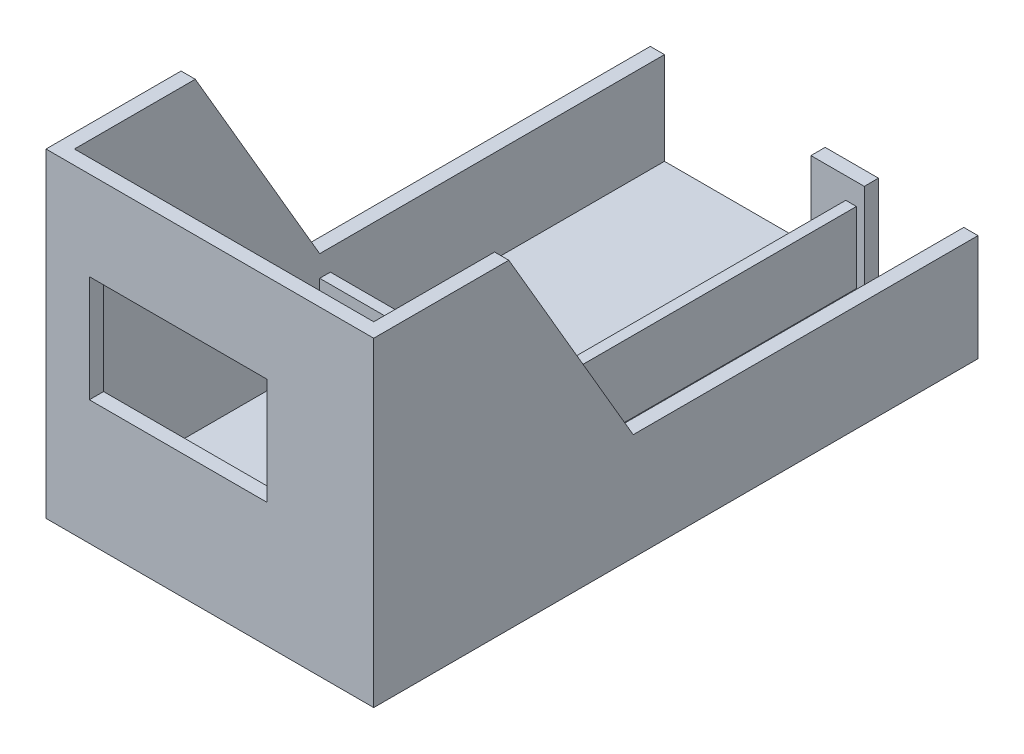
ISO-10303-21;
HEADER;
FILE_DESCRIPTION(('STEP AP214'),'2;1');
FILE_NAME('part.step','',(''),(''),'','','');
FILE_SCHEMA(('AUTOMOTIVE_DESIGN { 1 0 10303 214 1 1 1 1 }'));
ENDSEC;
DATA;
#1=APPLICATION_CONTEXT('core data for automotive mechanical design processes');
#2=APPLICATION_PROTOCOL_DEFINITION('international standard','automotive_design',2000,#1);
#3=PRODUCT_CONTEXT('',#1,'mechanical');
#4=PRODUCT('Part','Part','',(#3));
#5=PRODUCT_RELATED_PRODUCT_CATEGORY('part','',(#4));
#6=PRODUCT_DEFINITION_FORMATION('','',#4);
#7=PRODUCT_DEFINITION_CONTEXT('part definition',#1,'design');
#8=PRODUCT_DEFINITION('design','',#6,#7);
#9=PRODUCT_DEFINITION_SHAPE('','',#8);
#10=(LENGTH_UNIT() NAMED_UNIT(*) SI_UNIT(.MILLI.,.METRE.));
#11=(NAMED_UNIT(*) PLANE_ANGLE_UNIT() SI_UNIT($,.RADIAN.));
#12=(NAMED_UNIT(*) SI_UNIT($,.STERADIAN.) SOLID_ANGLE_UNIT());
#13=UNCERTAINTY_MEASURE_WITH_UNIT(LENGTH_MEASURE(1.E-05),#10,'distance_accuracy_value','');
#14=(GEOMETRIC_REPRESENTATION_CONTEXT(3) GLOBAL_UNCERTAINTY_ASSIGNED_CONTEXT((#13)) GLOBAL_UNIT_ASSIGNED_CONTEXT((#10,
#11,#12)) REPRESENTATION_CONTEXT('',''));
#15=CARTESIAN_POINT('',(0.,0.,0.));
#16=DIRECTION('',(0.,0.,1.));
#17=DIRECTION('',(1.,0.,0.));
#18=AXIS2_PLACEMENT_3D('',#15,#16,#17);
#19=CARTESIAN_POINT('',(-42.1,4.,-81.));
#20=DIRECTION('',(-1.,0.,0.));
#21=DIRECTION('',(0.,0.,1.));
#22=AXIS2_PLACEMENT_3D('',#19,#20,#21);
#23=PLANE('',#22);
#24=DIRECTION('',(0.,0.,1.));
#25=VECTOR('',#24,1.);
#26=CARTESIAN_POINT('',(-42.1,30.,-81.));
#27=LINE('',#26,#25);
#28=CARTESIAN_POINT('',(-42.1,30.,-85.));
#29=VERTEX_POINT('',#28);
#30=CARTESIAN_POINT('',(-42.1,30.,12.));
#31=VERTEX_POINT('',#30);
#32=EDGE_CURVE('E548',#29,#31,#27,.T.);
#33=ORIENTED_EDGE('',*,*,#32,.T.);
#34=DIRECTION('',(0.,0.863778900898433,0.503871025524086));
#35=VECTOR('',#34,1.);
#36=CARTESIAN_POINT('',(-42.1,-29.8756476683938,-22.9274611398964));
#37=LINE('',#36,#35);
#38=CARTESIAN_POINT('',(-42.1,90.,47.));
#39=VERTEX_POINT('',#38);
#40=EDGE_CURVE('E637',#31,#39,#37,.T.);
#41=ORIENTED_EDGE('',*,*,#40,.T.);
#42=DIRECTION('',(0.,0.,1.));
#43=VECTOR('',#42,1.);
#44=CARTESIAN_POINT('',(-42.1,90.,-81.));
#45=LINE('',#44,#43);
#46=CARTESIAN_POINT('',(-42.1,90.,81.));
#47=VERTEX_POINT('',#46);
#48=EDGE_CURVE('E522',#39,#47,#45,.T.);
#49=ORIENTED_EDGE('',*,*,#48,.T.);
#50=DIRECTION('',(0.,1.,0.));
#51=VECTOR('',#50,1.);
#52=CARTESIAN_POINT('',(-42.1,4.,81.));
#53=LINE('',#52,#51);
#54=CARTESIAN_POINT('',(-42.1,4.,81.));
#55=VERTEX_POINT('',#54);
#56=EDGE_CURVE('E297',#55,#47,#53,.T.);
#57=ORIENTED_EDGE('',*,*,#56,.F.);
#58=DIRECTION('',(0.,0.,1.));
#59=VECTOR('',#58,1.);
#60=CARTESIAN_POINT('',(-42.1,4.,-81.));
#61=LINE('',#60,#59);
#62=CARTESIAN_POINT('',(-42.1,4.,12.));
#63=VERTEX_POINT('',#62);
#64=EDGE_CURVE('E510',#63,#55,#61,.T.);
#65=ORIENTED_EDGE('',*,*,#64,.F.);
#66=DIRECTION('',(0.,-1.,0.));
#67=VECTOR('',#66,1.);
#68=CARTESIAN_POINT('',(-42.1,24.,12.));
#69=LINE('',#68,#67);
#70=CARTESIAN_POINT('',(-42.1,24.,12.));
#71=VERTEX_POINT('',#70);
#72=EDGE_CURVE('E471',#71,#63,#69,.T.);
#73=ORIENTED_EDGE('',*,*,#72,.F.);
#74=DIRECTION('',(0.,0.,-1.));
#75=VECTOR('',#74,1.);
#76=CARTESIAN_POINT('',(-42.1,24.,12.));
#77=LINE('',#76,#75);
#78=CARTESIAN_POINT('',(-42.1,24.,8.99999999999998));
#79=VERTEX_POINT('',#78);
#80=EDGE_CURVE('E442',#71,#79,#77,.T.);
#81=ORIENTED_EDGE('',*,*,#80,.T.);
#82=DIRECTION('',(0.,-1.,0.));
#83=VECTOR('',#82,1.);
#84=CARTESIAN_POINT('',(-42.1,24.,8.99999999999998));
#85=LINE('',#84,#83);
#86=CARTESIAN_POINT('',(-42.1,4.,8.99999999999998));
#87=VERTEX_POINT('',#86);
#88=EDGE_CURVE('E459',#79,#87,#85,.T.);
#89=ORIENTED_EDGE('',*,*,#88,.T.);
#90=CARTESIAN_POINT('',(-42.1,4.,-85.));
#91=VERTEX_POINT('',#90);
#92=EDGE_CURVE('E511',#91,#87,#61,.T.);
#93=ORIENTED_EDGE('',*,*,#92,.F.);
#94=DIRECTION('',(0.,1.,0.));
#95=VECTOR('',#94,1.);
#96=CARTESIAN_POINT('',(-42.1,4.,-85.));
#97=LINE('',#96,#95);
#98=EDGE_CURVE('E357',#91,#29,#97,.T.);
#99=ORIENTED_EDGE('',*,*,#98,.T.);
#100=EDGE_LOOP('',(#33,#41,#49,#57,#65,#73,#81,#89,#93,#99));
#101=FACE_BOUND('',#100,.T.);
#102=ADVANCED_FACE('F62',(#101),#23,.F.);
#103=CARTESIAN_POINT('',(-42.1,4.,-81.));
#104=DIRECTION('',(0.,0.,-1.));
#105=DIRECTION('',(-1.,0.,0.));
#106=AXIS2_PLACEMENT_3D('',#103,#104,#105);
#107=PLANE('',#106);
#108=DIRECTION('',(0.,1.,0.));
#109=VECTOR('',#108,1.);
#110=CARTESIAN_POINT('',(18.1,4.,-81.));
#111=LINE('',#110,#109);
#112=CARTESIAN_POINT('',(18.1,4.,-81.));
#113=VERTEX_POINT('',#112);
#114=CARTESIAN_POINT('',(18.1,30.,-81.));
#115=VERTEX_POINT('',#114);
#116=EDGE_CURVE('E374',#113,#115,#111,.T.);
#117=ORIENTED_EDGE('',*,*,#116,.T.);
#118=DIRECTION('',(-1.,0.,0.));
#119=VECTOR('',#118,1.);
#120=CARTESIAN_POINT('',(-42.1,30.,-81.));
#121=LINE('',#120,#119);
#122=CARTESIAN_POINT('',(3.1,30.,-81.));
#123=VERTEX_POINT('',#122);
#124=EDGE_CURVE('E86',#115,#123,#121,.T.);
#125=ORIENTED_EDGE('',*,*,#124,.T.);
#126=DIRECTION('',(0.,-1.,0.));
#127=VECTOR('',#126,1.);
#128=CARTESIAN_POINT('',(3.1,3.99999999999999,-81.));
#129=LINE('',#128,#127);
#130=CARTESIAN_POINT('',(3.1,3.99999999999999,-81.));
#131=VERTEX_POINT('',#130);
#132=EDGE_CURVE('E394',#123,#131,#129,.T.);
#133=ORIENTED_EDGE('',*,*,#132,.T.);
#134=DIRECTION('',(-1.,0.,0.));
#135=VECTOR('',#134,1.);
#136=CARTESIAN_POINT('',(-42.1,4.,-81.));
#137=LINE('',#136,#135);
#138=CARTESIAN_POINT('',(12.9,4.,-81.));
#139=VERTEX_POINT('',#138);
#140=EDGE_CURVE('E505',#139,#131,#137,.T.);
#141=ORIENTED_EDGE('',*,*,#140,.F.);
#142=DIRECTION('',(0.,-1.,0.));
#143=VECTOR('',#142,1.);
#144=CARTESIAN_POINT('',(12.9,24.,-81.));
#145=LINE('',#144,#143);
#146=CARTESIAN_POINT('',(12.9,24.,-81.));
#147=VERTEX_POINT('',#146);
#148=EDGE_CURVE('E429',#147,#139,#145,.T.);
#149=ORIENTED_EDGE('',*,*,#148,.F.);
#150=DIRECTION('',(1.,0.,0.));
#151=VECTOR('',#150,1.);
#152=CARTESIAN_POINT('',(12.9,24.,-81.));
#153=LINE('',#152,#151);
#154=CARTESIAN_POINT('',(15.9,24.,-81.));
#155=VERTEX_POINT('',#154);
#156=EDGE_CURVE('E410',#147,#155,#153,.T.);
#157=ORIENTED_EDGE('',*,*,#156,.T.);
#158=DIRECTION('',(0.,-1.,0.));
#159=VECTOR('',#158,1.);
#160=CARTESIAN_POINT('',(15.9,24.,-81.));
#161=LINE('',#160,#159);
#162=CARTESIAN_POINT('',(15.9,4.,-81.));
#163=VERTEX_POINT('',#162);
#164=EDGE_CURVE('E433',#155,#163,#161,.T.);
#165=ORIENTED_EDGE('',*,*,#164,.T.);
#166=EDGE_CURVE('E507',#113,#163,#137,.T.);
#167=ORIENTED_EDGE('',*,*,#166,.F.);
#168=EDGE_LOOP('',(#117,#125,#133,#141,#149,#157,#165,#167));
#169=FACE_BOUND('',#168,.T.);
#170=ADVANCED_FACE('F591',(#169),#107,.F.);
#171=CARTESIAN_POINT('',(0.,4.,0.));
#172=DIRECTION('',(0.,1.,0.));
#173=DIRECTION('',(0.,0.,1.));
#174=AXIS2_PLACEMENT_3D('',#171,#172,#173);
#175=PLANE('',#174);
#176=DIRECTION('',(0.,0.,-1.));
#177=VECTOR('',#176,1.);
#178=CARTESIAN_POINT('',(16.1,4.,81.));
#179=LINE('',#178,#177);
#180=CARTESIAN_POINT('',(16.1,4.,81.));
#181=VERTEX_POINT('',#180);
#182=CARTESIAN_POINT('',(16.1,4.,12.));
#183=VERTEX_POINT('',#182);
#184=EDGE_CURVE('E393',#181,#183,#179,.T.);
#185=ORIENTED_EDGE('',*,*,#184,.T.);
#186=DIRECTION('',(1.,0.,0.));
#187=VECTOR('',#186,1.);
#188=CARTESIAN_POINT('',(-42.1,4.,12.));
#189=LINE('',#188,#187);
#190=EDGE_CURVE('E446',#63,#183,#189,.T.);
#191=ORIENTED_EDGE('',*,*,#190,.F.);
#192=ORIENTED_EDGE('',*,*,#64,.T.);
#193=DIRECTION('',(1.,0.,0.));
#194=VECTOR('',#193,1.);
#195=CARTESIAN_POINT('',(-42.1,4.,81.));
#196=LINE('',#195,#194);
#197=EDGE_CURVE('E516',#55,#181,#196,.T.);
#198=ORIENTED_EDGE('',*,*,#197,.T.);
#199=EDGE_LOOP('',(#185,#191,#192,#198));
#200=FACE_BOUND('',#199,.T.);
#201=ADVANCED_FACE('F596',(#200),#175,.T.);
#202=DIRECTION('',(0.,0.,-1.));
#203=VECTOR('',#202,1.);
#204=CARTESIAN_POINT('',(42.1,4.,-81.));
#205=LINE('',#204,#203);
#206=CARTESIAN_POINT('',(42.1,4.,81.));
#207=VERTEX_POINT('',#206);
#208=CARTESIAN_POINT('',(42.1,4.,-85.));
#209=VERTEX_POINT('',#208);
#210=EDGE_CURVE('E501',#207,#209,#205,.T.);
#211=ORIENTED_EDGE('',*,*,#210,.T.);
#212=DIRECTION('',(-1.,0.,0.));
#213=VECTOR('',#212,1.);
#214=CARTESIAN_POINT('',(42.1,4.,-85.));
#215=LINE('',#214,#213);
#216=CARTESIAN_POINT('',(18.1,4.,-85.));
#217=VERTEX_POINT('',#216);
#218=EDGE_CURVE('E383',#209,#217,#215,.T.);
#219=ORIENTED_EDGE('',*,*,#218,.T.);
#220=DIRECTION('',(0.,0.,-1.));
#221=VECTOR('',#220,1.);
#222=CARTESIAN_POINT('',(18.1,4.,-81.));
#223=LINE('',#222,#221);
#224=EDGE_CURVE('E378',#113,#217,#223,.T.);
#225=ORIENTED_EDGE('',*,*,#224,.F.);
#226=ORIENTED_EDGE('',*,*,#166,.T.);
#227=DIRECTION('',(0.,0.,-1.));
#228=VECTOR('',#227,1.);
#229=CARTESIAN_POINT('',(15.9,4.,8.99999999999998));
#230=LINE('',#229,#228);
#231=CARTESIAN_POINT('',(15.9,4.,8.99999999999998));
#232=VERTEX_POINT('',#231);
#233=EDGE_CURVE('E419',#232,#163,#230,.T.);
#234=ORIENTED_EDGE('',*,*,#233,.F.);
#235=DIRECTION('',(1.,0.,0.));
#236=VECTOR('',#235,1.);
#237=CARTESIAN_POINT('',(-42.1,4.,8.99999999999998));
#238=LINE('',#237,#236);
#239=CARTESIAN_POINT('',(19.1,4.,8.99999999999998));
#240=VERTEX_POINT('',#239);
#241=EDGE_CURVE('E464',#232,#240,#238,.T.);
#242=ORIENTED_EDGE('',*,*,#241,.T.);
#243=DIRECTION('',(0.,0.,-1.));
#244=VECTOR('',#243,1.);
#245=CARTESIAN_POINT('',(19.1,4.,12.));
#246=LINE('',#245,#244);
#247=CARTESIAN_POINT('',(19.0999999999999,4.,81.));
#248=VERTEX_POINT('',#247);
#249=EDGE_CURVE('E463',#248,#240,#246,.T.);
#250=ORIENTED_EDGE('',*,*,#249,.F.);
#251=EDGE_CURVE('E515',#248,#207,#196,.T.);
#252=ORIENTED_EDGE('',*,*,#251,.T.);
#253=EDGE_LOOP('',(#211,#219,#225,#226,#234,#242,#250,#252));
#254=FACE_BOUND('',#253,.T.);
#255=ADVANCED_FACE('F621',(#254),#175,.T.);
#256=CARTESIAN_POINT('',(46.1,90.,-85.));
#257=DIRECTION('',(-1.,0.,0.));
#258=DIRECTION('',(0.,0.,1.));
#259=AXIS2_PLACEMENT_3D('',#256,#257,#258);
#260=PLANE('',#259);
#261=DIRECTION('',(0.,0.,-1.));
#262=VECTOR('',#261,1.);
#263=CARTESIAN_POINT('',(46.1,30.,12.));
#264=LINE('',#263,#262);
#265=CARTESIAN_POINT('',(46.1,30.,12.));
#266=VERTEX_POINT('',#265);
#267=CARTESIAN_POINT('',(46.1,30.,-85.));
#268=VERTEX_POINT('',#267);
#269=EDGE_CURVE('E279',#266,#268,#264,.T.);
#270=ORIENTED_EDGE('',*,*,#269,.F.);
#271=DIRECTION('',(0.,-0.863778900898433,-0.503871025524086));
#272=VECTOR('',#271,1.);
#273=CARTESIAN_POINT('',(46.1,30.,12.));
#274=LINE('',#273,#272);
#275=CARTESIAN_POINT('',(46.1,90.,47.));
#276=VERTEX_POINT('',#275);
#277=EDGE_CURVE('E262',#276,#266,#274,.T.);
#278=ORIENTED_EDGE('',*,*,#277,.F.);
#279=DIRECTION('',(0.,0.,-1.));
#280=VECTOR('',#279,1.);
#281=CARTESIAN_POINT('',(46.1,90.,-85.));
#282=LINE('',#281,#280);
#283=CARTESIAN_POINT('',(46.1,90.,85.));
#284=VERTEX_POINT('',#283);
#285=EDGE_CURVE('E277',#284,#276,#282,.T.);
#286=ORIENTED_EDGE('',*,*,#285,.F.);
#287=DIRECTION('',(0.,-1.,0.));
#288=VECTOR('',#287,1.);
#289=CARTESIAN_POINT('',(46.1,90.,85.));
#290=LINE('',#289,#288);
#291=CARTESIAN_POINT('',(46.1,0.,85.));
#292=VERTEX_POINT('',#291);
#293=EDGE_CURVE('E302',#284,#292,#290,.T.);
#294=ORIENTED_EDGE('',*,*,#293,.T.);
#295=DIRECTION('',(0.,0.,-1.));
#296=VECTOR('',#295,1.);
#297=CARTESIAN_POINT('',(46.1,0.,-85.));
#298=LINE('',#297,#296);
#299=CARTESIAN_POINT('',(46.1,0.,-85.));
#300=VERTEX_POINT('',#299);
#301=EDGE_CURVE('E303',#292,#300,#298,.T.);
#302=ORIENTED_EDGE('',*,*,#301,.T.);
#303=DIRECTION('',(0.,-1.,0.));
#304=VECTOR('',#303,1.);
#305=CARTESIAN_POINT('',(46.1,90.,-85.));
#306=LINE('',#305,#304);
#307=EDGE_CURVE('E323',#268,#300,#306,.T.);
#308=ORIENTED_EDGE('',*,*,#307,.F.);
#309=EDGE_LOOP('',(#270,#278,#286,#294,#302,#308));
#310=FACE_BOUND('',#309,.T.);
#311=ADVANCED_FACE('F64',(#310),#260,.F.);
#312=CARTESIAN_POINT('',(-46.1,90.,-85.));
#313=DIRECTION('',(0.,0.,1.));
#314=DIRECTION('',(1.,0.,0.));
#315=AXIS2_PLACEMENT_3D('',#312,#313,#314);
#316=PLANE('',#315);
#317=DIRECTION('',(0.,-1.,0.));
#318=VECTOR('',#317,1.);
#319=CARTESIAN_POINT('',(-46.1,90.,-85.));
#320=LINE('',#319,#318);
#321=CARTESIAN_POINT('',(-46.1,30.,-85.));
#322=VERTEX_POINT('',#321);
#323=CARTESIAN_POINT('',(-46.1,0.,-85.));
#324=VERTEX_POINT('',#323);
#325=EDGE_CURVE('E320',#322,#324,#320,.T.);
#326=ORIENTED_EDGE('',*,*,#325,.F.);
#327=DIRECTION('',(-1.,0.,0.));
#328=VECTOR('',#327,1.);
#329=CARTESIAN_POINT('',(-46.1,30.,-85.));
#330=LINE('',#329,#328);
#331=EDGE_CURVE('E625',#29,#322,#330,.T.);
#332=ORIENTED_EDGE('',*,*,#331,.F.);
#333=ORIENTED_EDGE('',*,*,#98,.F.);
#334=DIRECTION('',(-1.,0.,0.));
#335=VECTOR('',#334,1.);
#336=CARTESIAN_POINT('',(-42.1,4.,-85.));
#337=LINE('',#336,#335);
#338=CARTESIAN_POINT('',(3.1,3.99999999999999,-85.));
#339=VERTEX_POINT('',#338);
#340=EDGE_CURVE('E396',#339,#91,#337,.T.);
#341=ORIENTED_EDGE('',*,*,#340,.F.);
#342=DIRECTION('',(0.,-1.,0.));
#343=VECTOR('',#342,1.);
#344=CARTESIAN_POINT('',(3.1,3.99999999999999,-85.));
#345=LINE('',#344,#343);
#346=CARTESIAN_POINT('',(3.09999999999998,30.,-85.));
#347=VERTEX_POINT('',#346);
#348=EDGE_CURVE('E363',#347,#339,#345,.T.);
#349=ORIENTED_EDGE('',*,*,#348,.F.);
#350=CARTESIAN_POINT('',(18.1,30.,-85.));
#351=VERTEX_POINT('',#350);
#352=EDGE_CURVE('E651',#351,#347,#330,.T.);
#353=ORIENTED_EDGE('',*,*,#352,.F.);
#354=DIRECTION('',(0.,1.,0.));
#355=VECTOR('',#354,1.);
#356=CARTESIAN_POINT('',(18.1,4.,-85.));
#357=LINE('',#356,#355);
#358=EDGE_CURVE('E379',#217,#351,#357,.T.);
#359=ORIENTED_EDGE('',*,*,#358,.F.);
#360=ORIENTED_EDGE('',*,*,#218,.F.);
#361=DIRECTION('',(0.,-1.,0.));
#362=VECTOR('',#361,1.);
#363=CARTESIAN_POINT('',(42.1,4.,-85.));
#364=LINE('',#363,#362);
#365=CARTESIAN_POINT('',(42.1,30.,-85.));
#366=VERTEX_POINT('',#365);
#367=EDGE_CURVE('E380',#366,#209,#364,.T.);
#368=ORIENTED_EDGE('',*,*,#367,.F.);
#369=EDGE_CURVE('E78',#268,#366,#330,.T.);
#370=ORIENTED_EDGE('',*,*,#369,.F.);
#371=ORIENTED_EDGE('',*,*,#307,.T.);
#372=DIRECTION('',(-1.,0.,0.));
#373=VECTOR('',#372,1.);
#374=CARTESIAN_POINT('',(-46.1,0.,-85.));
#375=LINE('',#374,#373);
#376=EDGE_CURVE('E307',#300,#324,#375,.T.);
#377=ORIENTED_EDGE('',*,*,#376,.T.);
#378=EDGE_LOOP('',(#326,#332,#333,#341,#349,#353,#359,#360,#368,#370,#371,#377));
#379=FACE_BOUND('',#378,.T.);
#380=ADVANCED_FACE('F614',(#379),#316,.F.);
#381=CARTESIAN_POINT('',(-46.1,90.,-85.));
#382=DIRECTION('',(1.,0.,0.));
#383=DIRECTION('',(0.,0.,-1.));
#384=AXIS2_PLACEMENT_3D('',#381,#382,#383);
#385=PLANE('',#384);
#386=DIRECTION('',(0.,0.,1.));
#387=VECTOR('',#386,1.);
#388=CARTESIAN_POINT('',(-46.1,90.,-85.));
#389=LINE('',#388,#387);
#390=CARTESIAN_POINT('',(-46.1,90.,47.));
#391=VERTEX_POINT('',#390);
#392=CARTESIAN_POINT('',(-46.1,90.,85.));
#393=VERTEX_POINT('',#392);
#394=EDGE_CURVE('E288',#391,#393,#389,.T.);
#395=ORIENTED_EDGE('',*,*,#394,.F.);
#396=DIRECTION('',(0.,-0.863778900898434,-0.503871025524086));
#397=VECTOR('',#396,1.);
#398=CARTESIAN_POINT('',(-46.1,32.5492227979275,13.4870466321244));
#399=LINE('',#398,#397);
#400=CARTESIAN_POINT('',(-46.1,30.,12.));
#401=VERTEX_POINT('',#400);
#402=EDGE_CURVE('E543',#391,#401,#399,.T.);
#403=ORIENTED_EDGE('',*,*,#402,.T.);
#404=DIRECTION('',(0.,0.,1.));
#405=VECTOR('',#404,1.);
#406=CARTESIAN_POINT('',(-46.1,30.,12.));
#407=LINE('',#406,#405);
#408=EDGE_CURVE('E633',#322,#401,#407,.T.);
#409=ORIENTED_EDGE('',*,*,#408,.F.);
#410=ORIENTED_EDGE('',*,*,#325,.T.);
#411=DIRECTION('',(0.,0.,1.));
#412=VECTOR('',#411,1.);
#413=CARTESIAN_POINT('',(-46.1,0.,-85.));
#414=LINE('',#413,#412);
#415=CARTESIAN_POINT('',(-46.1,0.,85.));
#416=VERTEX_POINT('',#415);
#417=EDGE_CURVE('E294',#324,#416,#414,.T.);
#418=ORIENTED_EDGE('',*,*,#417,.T.);
#419=DIRECTION('',(0.,-1.,0.));
#420=VECTOR('',#419,1.);
#421=CARTESIAN_POINT('',(-46.1,90.,85.));
#422=LINE('',#421,#420);
#423=EDGE_CURVE('E316',#393,#416,#422,.T.);
#424=ORIENTED_EDGE('',*,*,#423,.F.);
#425=EDGE_LOOP('',(#395,#403,#409,#410,#418,#424));
#426=FACE_BOUND('',#425,.T.);
#427=ADVANCED_FACE('F612',(#426),#385,.F.);
#428=CARTESIAN_POINT('',(-46.1,90.,85.));
#429=DIRECTION('',(0.,0.,-1.));
#430=DIRECTION('',(-1.,0.,0.));
#431=AXIS2_PLACEMENT_3D('',#428,#429,#430);
#432=PLANE('',#431);
#433=DIRECTION('',(-1.,0.,0.));
#434=VECTOR('',#433,1.);
#435=CARTESIAN_POINT('',(-33.9,65.,85.));
#436=LINE('',#435,#434);
#437=CARTESIAN_POINT('',(16.1,65.,85.));
#438=VERTEX_POINT('',#437);
#439=CARTESIAN_POINT('',(-33.9,65.,85.));
#440=VERTEX_POINT('',#439);
#441=EDGE_CURVE('E562',#438,#440,#436,.T.);
#442=ORIENTED_EDGE('',*,*,#441,.F.);
#443=DIRECTION('',(0.,1.,0.));
#444=VECTOR('',#443,1.);
#445=CARTESIAN_POINT('',(16.1,65.,85.));
#446=LINE('',#445,#444);
#447=CARTESIAN_POINT('',(16.1,35.,85.));
#448=VERTEX_POINT('',#447);
#449=EDGE_CURVE('E554',#448,#438,#446,.T.);
#450=ORIENTED_EDGE('',*,*,#449,.F.);
#451=DIRECTION('',(1.,0.,0.));
#452=VECTOR('',#451,1.);
#453=CARTESIAN_POINT('',(-33.9,35.,85.));
#454=LINE('',#453,#452);
#455=CARTESIAN_POINT('',(-33.9,35.,85.));
#456=VERTEX_POINT('',#455);
#457=EDGE_CURVE('E354',#456,#448,#454,.T.);
#458=ORIENTED_EDGE('',*,*,#457,.F.);
#459=DIRECTION('',(0.,-1.,0.));
#460=VECTOR('',#459,1.);
#461=CARTESIAN_POINT('',(-33.9,65.,85.));
#462=LINE('',#461,#460);
#463=EDGE_CURVE('E565',#440,#456,#462,.T.);
#464=ORIENTED_EDGE('',*,*,#463,.F.);
#465=EDGE_LOOP('',(#442,#450,#458,#464));
#466=FACE_BOUND('',#465,.T.);
#467=DIRECTION('',(1.,0.,0.));
#468=VECTOR('',#467,1.);
#469=CARTESIAN_POINT('',(-46.1,0.,85.));
#470=LINE('',#469,#468);
#471=EDGE_CURVE('E289',#416,#292,#470,.T.);
#472=ORIENTED_EDGE('',*,*,#471,.T.);
#473=ORIENTED_EDGE('',*,*,#293,.F.);
#474=DIRECTION('',(1.,0.,0.));
#475=VECTOR('',#474,1.);
#476=CARTESIAN_POINT('',(-46.1,90.,85.));
#477=LINE('',#476,#475);
#478=EDGE_CURVE('E285',#393,#284,#477,.T.);
#479=ORIENTED_EDGE('',*,*,#478,.F.);
#480=ORIENTED_EDGE('',*,*,#423,.T.);
#481=EDGE_LOOP('',(#472,#473,#479,#480));
#482=FACE_BOUND('',#481,.T.);
#483=ADVANCED_FACE('F575',(#466,#482),#432,.F.);
#484=CARTESIAN_POINT('',(0.,90.,0.));
#485=DIRECTION('',(0.,1.,0.));
#486=DIRECTION('',(0.,0.,1.));
#487=AXIS2_PLACEMENT_3D('',#484,#485,#486);
#488=PLANE('',#487);
#489=DIRECTION('',(1.,0.,0.));
#490=VECTOR('',#489,1.);
#491=CARTESIAN_POINT('',(-53.9,90.,47.));
#492=LINE('',#491,#490);
#493=EDGE_CURVE('E271',#391,#39,#492,.T.);
#494=ORIENTED_EDGE('',*,*,#493,.F.);
#495=ORIENTED_EDGE('',*,*,#394,.T.);
#496=ORIENTED_EDGE('',*,*,#478,.T.);
#497=ORIENTED_EDGE('',*,*,#285,.T.);
#498=CARTESIAN_POINT('',(42.1,90.,47.));
#499=VERTEX_POINT('',#498);
#500=EDGE_CURVE('E259',#499,#276,#492,.T.);
#501=ORIENTED_EDGE('',*,*,#500,.F.);
#502=DIRECTION('',(0.,0.,-1.));
#503=VECTOR('',#502,1.);
#504=CARTESIAN_POINT('',(42.1,90.,-81.));
#505=LINE('',#504,#503);
#506=CARTESIAN_POINT('',(42.1,90.,81.));
#507=VERTEX_POINT('',#506);
#508=EDGE_CURVE('E441',#507,#499,#505,.T.);
#509=ORIENTED_EDGE('',*,*,#508,.F.);
#510=DIRECTION('',(1.,0.,0.));
#511=VECTOR('',#510,1.);
#512=CARTESIAN_POINT('',(-42.1,90.,81.));
#513=LINE('',#512,#511);
#514=EDGE_CURVE('E506',#47,#507,#513,.T.);
#515=ORIENTED_EDGE('',*,*,#514,.F.);
#516=ORIENTED_EDGE('',*,*,#48,.F.);
#517=EDGE_LOOP('',(#494,#495,#496,#497,#501,#509,#515,#516));
#518=FACE_BOUND('',#517,.T.);
#519=ADVANCED_FACE('F283',(#518),#488,.T.);
#520=CARTESIAN_POINT('',(0.,0.,0.));
#521=DIRECTION('',(0.,1.,0.));
#522=DIRECTION('',(0.,0.,1.));
#523=AXIS2_PLACEMENT_3D('',#520,#521,#522);
#524=PLANE('',#523);
#525=ORIENTED_EDGE('',*,*,#301,.F.);
#526=ORIENTED_EDGE('',*,*,#471,.F.);
#527=ORIENTED_EDGE('',*,*,#417,.F.);
#528=ORIENTED_EDGE('',*,*,#376,.F.);
#529=EDGE_LOOP('',(#525,#526,#527,#528));
#530=FACE_BOUND('',#529,.T.);
#531=ADVANCED_FACE('F604',(#530),#524,.F.);
#532=CARTESIAN_POINT('',(42.1,4.,-81.));
#533=DIRECTION('',(1.,0.,0.));
#534=DIRECTION('',(0.,0.,-1.));
#535=AXIS2_PLACEMENT_3D('',#532,#533,#534);
#536=PLANE('',#535);
#537=ORIENTED_EDGE('',*,*,#508,.T.);
#538=DIRECTION('',(0.,-0.863778900898433,-0.503871025524086));
#539=VECTOR('',#538,1.);
#540=CARTESIAN_POINT('',(42.1,-29.8756476683938,-22.9274611398964));
#541=LINE('',#540,#539);
#542=CARTESIAN_POINT('',(42.1,30.,12.));
#543=VERTEX_POINT('',#542);
#544=EDGE_CURVE('E265',#499,#543,#541,.T.);
#545=ORIENTED_EDGE('',*,*,#544,.T.);
#546=DIRECTION('',(0.,0.,-1.));
#547=VECTOR('',#546,1.);
#548=CARTESIAN_POINT('',(42.1,30.,-81.));
#549=LINE('',#548,#547);
#550=EDGE_CURVE('E540',#543,#366,#549,.T.);
#551=ORIENTED_EDGE('',*,*,#550,.T.);
#552=ORIENTED_EDGE('',*,*,#367,.T.);
#553=ORIENTED_EDGE('',*,*,#210,.F.);
#554=DIRECTION('',(0.,1.,0.));
#555=VECTOR('',#554,1.);
#556=CARTESIAN_POINT('',(42.1,4.,81.));
#557=LINE('',#556,#555);
#558=EDGE_CURVE('E308',#207,#507,#557,.T.);
#559=ORIENTED_EDGE('',*,*,#558,.T.);
#560=EDGE_LOOP('',(#537,#545,#551,#552,#553,#559));
#561=FACE_BOUND('',#560,.T.);
#562=ADVANCED_FACE('F539',(#561),#536,.F.);
#563=CARTESIAN_POINT('',(-42.1,4.,81.));
#564=DIRECTION('',(0.,0.,1.));
#565=DIRECTION('',(1.,0.,0.));
#566=AXIS2_PLACEMENT_3D('',#563,#564,#565);
#567=PLANE('',#566);
#568=DIRECTION('',(1.,0.,0.));
#569=VECTOR('',#568,1.);
#570=CARTESIAN_POINT('',(-42.1,35.,81.));
#571=LINE('',#570,#569);
#572=CARTESIAN_POINT('',(-33.9,35.,81.));
#573=VERTEX_POINT('',#572);
#574=CARTESIAN_POINT('',(16.1,35.,81.));
#575=VERTEX_POINT('',#574);
#576=EDGE_CURVE('E334',#573,#575,#571,.T.);
#577=ORIENTED_EDGE('',*,*,#576,.T.);
#578=DIRECTION('',(0.,1.,0.));
#579=VECTOR('',#578,1.);
#580=CARTESIAN_POINT('',(16.1,4.00000000000001,81.));
#581=LINE('',#580,#579);
#582=CARTESIAN_POINT('',(16.1,65.,81.));
#583=VERTEX_POINT('',#582);
#584=EDGE_CURVE('E71',#575,#583,#581,.T.);
#585=ORIENTED_EDGE('',*,*,#584,.T.);
#586=DIRECTION('',(-1.,0.,0.));
#587=VECTOR('',#586,1.);
#588=CARTESIAN_POINT('',(-42.1,65.,81.));
#589=LINE('',#588,#587);
#590=CARTESIAN_POINT('',(-33.9,65.,81.));
#591=VERTEX_POINT('',#590);
#592=EDGE_CURVE('E326',#583,#591,#589,.T.);
#593=ORIENTED_EDGE('',*,*,#592,.T.);
#594=DIRECTION('',(0.,-1.,0.));
#595=VECTOR('',#594,1.);
#596=CARTESIAN_POINT('',(-33.9,4.,81.));
#597=LINE('',#596,#595);
#598=EDGE_CURVE('E330',#591,#573,#597,.T.);
#599=ORIENTED_EDGE('',*,*,#598,.T.);
#600=EDGE_LOOP('',(#577,#585,#593,#599));
#601=FACE_BOUND('',#600,.T.);
#602=DIRECTION('',(1.,0.,0.));
#603=VECTOR('',#602,1.);
#604=CARTESIAN_POINT('',(16.1,24.,81.));
#605=LINE('',#604,#603);
#606=CARTESIAN_POINT('',(16.1,24.,81.));
#607=VERTEX_POINT('',#606);
#608=CARTESIAN_POINT('',(19.0999999999999,24.,81.));
#609=VERTEX_POINT('',#608);
#610=EDGE_CURVE('E481',#607,#609,#605,.T.);
#611=ORIENTED_EDGE('',*,*,#610,.F.);
#612=DIRECTION('',(0.,-1.,0.));
#613=VECTOR('',#612,1.);
#614=CARTESIAN_POINT('',(16.1,24.,81.));
#615=LINE('',#614,#613);
#616=EDGE_CURVE('E489',#607,#181,#615,.T.);
#617=ORIENTED_EDGE('',*,*,#616,.T.);
#618=ORIENTED_EDGE('',*,*,#197,.F.);
#619=ORIENTED_EDGE('',*,*,#56,.T.);
#620=ORIENTED_EDGE('',*,*,#514,.T.);
#621=ORIENTED_EDGE('',*,*,#558,.F.);
#622=ORIENTED_EDGE('',*,*,#251,.F.);
#623=DIRECTION('',(0.,-1.,0.));
#624=VECTOR('',#623,1.);
#625=CARTESIAN_POINT('',(19.1,24.,81.));
#626=LINE('',#625,#624);
#627=EDGE_CURVE('E494',#609,#248,#626,.T.);
#628=ORIENTED_EDGE('',*,*,#627,.F.);
#629=EDGE_LOOP('',(#611,#617,#618,#619,#620,#621,#622,#628));
#630=FACE_BOUND('',#629,.T.);
#631=ADVANCED_FACE('F340',(#601,#630),#567,.F.);
#632=DIRECTION('',(0.,0.,-1.));
#633=VECTOR('',#632,1.);
#634=CARTESIAN_POINT('',(12.9,4.,8.99999999999998));
#635=LINE('',#634,#633);
#636=CARTESIAN_POINT('',(12.9,4.,8.99999999999998));
#637=VERTEX_POINT('',#636);
#638=EDGE_CURVE('E411',#637,#139,#635,.T.);
#639=ORIENTED_EDGE('',*,*,#638,.T.);
#640=ORIENTED_EDGE('',*,*,#140,.T.);
#641=DIRECTION('',(0.,0.,-1.));
#642=VECTOR('',#641,1.);
#643=CARTESIAN_POINT('',(3.1,3.99999999999999,-81.));
#644=LINE('',#643,#642);
#645=EDGE_CURVE('E384',#131,#339,#644,.T.);
#646=ORIENTED_EDGE('',*,*,#645,.T.);
#647=ORIENTED_EDGE('',*,*,#340,.T.);
#648=ORIENTED_EDGE('',*,*,#92,.T.);
#649=EDGE_CURVE('E460',#87,#637,#238,.T.);
#650=ORIENTED_EDGE('',*,*,#649,.T.);
#651=EDGE_LOOP('',(#639,#640,#646,#647,#648,#650));
#652=FACE_BOUND('',#651,.T.);
#653=ADVANCED_FACE('F664',(#652),#175,.T.);
#654=CARTESIAN_POINT('',(15.9,24.,8.99999999999998));
#655=DIRECTION('',(-1.,0.,0.));
#656=DIRECTION('',(0.,0.,1.));
#657=AXIS2_PLACEMENT_3D('',#654,#655,#656);
#658=PLANE('',#657);
#659=ORIENTED_EDGE('',*,*,#233,.T.);
#660=ORIENTED_EDGE('',*,*,#164,.F.);
#661=DIRECTION('',(0.,0.,-1.));
#662=VECTOR('',#661,1.);
#663=CARTESIAN_POINT('',(15.9,24.,8.99999999999998));
#664=LINE('',#663,#662);
#665=CARTESIAN_POINT('',(15.9,24.,8.99999999999998));
#666=VERTEX_POINT('',#665);
#667=EDGE_CURVE('E406',#666,#155,#664,.T.);
#668=ORIENTED_EDGE('',*,*,#667,.F.);
#669=DIRECTION('',(0.,-1.,0.));
#670=VECTOR('',#669,1.);
#671=CARTESIAN_POINT('',(15.9,24.,8.99999999999998));
#672=LINE('',#671,#670);
#673=EDGE_CURVE('E437',#666,#232,#672,.T.);
#674=ORIENTED_EDGE('',*,*,#673,.T.);
#675=EDGE_LOOP('',(#659,#660,#668,#674));
#676=FACE_BOUND('',#675,.T.);
#677=ADVANCED_FACE('F734',(#676),#658,.F.);
#678=CARTESIAN_POINT('',(12.9,24.,8.99999999999998));
#679=DIRECTION('',(-1.,0.,0.));
#680=DIRECTION('',(0.,0.,1.));
#681=AXIS2_PLACEMENT_3D('',#678,#679,#680);
#682=PLANE('',#681);
#683=ORIENTED_EDGE('',*,*,#638,.F.);
#684=DIRECTION('',(0.,-1.,0.));
#685=VECTOR('',#684,1.);
#686=CARTESIAN_POINT('',(12.9,24.,8.99999999999998));
#687=LINE('',#686,#685);
#688=CARTESIAN_POINT('',(12.9,24.,8.99999999999998));
#689=VERTEX_POINT('',#688);
#690=EDGE_CURVE('E418',#689,#637,#687,.T.);
#691=ORIENTED_EDGE('',*,*,#690,.F.);
#692=DIRECTION('',(0.,0.,-1.));
#693=VECTOR('',#692,1.);
#694=CARTESIAN_POINT('',(12.9,24.,8.99999999999998));
#695=LINE('',#694,#693);
#696=EDGE_CURVE('E414',#689,#147,#695,.T.);
#697=ORIENTED_EDGE('',*,*,#696,.T.);
#698=ORIENTED_EDGE('',*,*,#148,.T.);
#699=EDGE_LOOP('',(#683,#691,#697,#698));
#700=FACE_BOUND('',#699,.T.);
#701=ADVANCED_FACE('F731',(#700),#682,.T.);
#702=CARTESIAN_POINT('',(0.,24.,0.));
#703=DIRECTION('',(0.,1.,0.));
#704=DIRECTION('',(0.,0.,1.));
#705=AXIS2_PLACEMENT_3D('',#702,#703,#704);
#706=PLANE('',#705);
#707=ORIENTED_EDGE('',*,*,#696,.F.);
#708=DIRECTION('',(1.,0.,0.));
#709=VECTOR('',#708,1.);
#710=CARTESIAN_POINT('',(-42.1,24.,8.99999999999998));
#711=LINE('',#710,#709);
#712=EDGE_CURVE('E447',#79,#689,#711,.T.);
#713=ORIENTED_EDGE('',*,*,#712,.F.);
#714=ORIENTED_EDGE('',*,*,#80,.F.);
#715=DIRECTION('',(1.,0.,0.));
#716=VECTOR('',#715,1.);
#717=CARTESIAN_POINT('',(-42.1,24.,12.));
#718=LINE('',#717,#716);
#719=CARTESIAN_POINT('',(16.1,24.,12.));
#720=VERTEX_POINT('',#719);
#721=EDGE_CURVE('E455',#71,#720,#718,.T.);
#722=ORIENTED_EDGE('',*,*,#721,.T.);
#723=DIRECTION('',(0.,0.,-1.));
#724=VECTOR('',#723,1.);
#725=CARTESIAN_POINT('',(16.1,24.,81.));
#726=LINE('',#725,#724);
#727=EDGE_CURVE('E485',#607,#720,#726,.T.);
#728=ORIENTED_EDGE('',*,*,#727,.F.);
#729=ORIENTED_EDGE('',*,*,#610,.T.);
#730=DIRECTION('',(0.,0.,-1.));
#731=VECTOR('',#730,1.);
#732=CARTESIAN_POINT('',(19.1,24.,12.));
#733=LINE('',#732,#731);
#734=CARTESIAN_POINT('',(19.1,24.,8.99999999999998));
#735=VERTEX_POINT('',#734);
#736=EDGE_CURVE('E451',#609,#735,#733,.T.);
#737=ORIENTED_EDGE('',*,*,#736,.T.);
#738=EDGE_CURVE('E445',#666,#735,#711,.T.);
#739=ORIENTED_EDGE('',*,*,#738,.F.);
#740=ORIENTED_EDGE('',*,*,#667,.T.);
#741=ORIENTED_EDGE('',*,*,#156,.F.);
#742=EDGE_LOOP('',(#707,#713,#714,#722,#728,#729,#737,#739,#740,#741));
#743=FACE_BOUND('',#742,.T.);
#744=ADVANCED_FACE('F692',(#743),#706,.T.);
#745=CARTESIAN_POINT('',(16.1,24.,81.));
#746=DIRECTION('',(-1.,0.,0.));
#747=DIRECTION('',(0.,0.,1.));
#748=AXIS2_PLACEMENT_3D('',#745,#746,#747);
#749=PLANE('',#748);
#750=ORIENTED_EDGE('',*,*,#184,.F.);
#751=ORIENTED_EDGE('',*,*,#616,.F.);
#752=ORIENTED_EDGE('',*,*,#727,.T.);
#753=DIRECTION('',(0.,-1.,0.));
#754=VECTOR('',#753,1.);
#755=CARTESIAN_POINT('',(16.1,24.,12.));
#756=LINE('',#755,#754);
#757=EDGE_CURVE('E423',#720,#183,#756,.T.);
#758=ORIENTED_EDGE('',*,*,#757,.T.);
#759=EDGE_LOOP('',(#750,#751,#752,#758));
#760=FACE_BOUND('',#759,.T.);
#761=ADVANCED_FACE('F730',(#760),#749,.T.);
#762=CARTESIAN_POINT('',(-42.1,24.,12.));
#763=DIRECTION('',(0.,0.,-1.));
#764=DIRECTION('',(-1.,0.,0.));
#765=AXIS2_PLACEMENT_3D('',#762,#763,#764);
#766=PLANE('',#765);
#767=ORIENTED_EDGE('',*,*,#757,.F.);
#768=ORIENTED_EDGE('',*,*,#721,.F.);
#769=ORIENTED_EDGE('',*,*,#72,.T.);
#770=ORIENTED_EDGE('',*,*,#190,.T.);
#771=EDGE_LOOP('',(#767,#768,#769,#770));
#772=FACE_BOUND('',#771,.T.);
#773=ADVANCED_FACE('F686',(#772),#766,.F.);
#774=CARTESIAN_POINT('',(19.1,24.,12.));
#775=DIRECTION('',(-1.,0.,0.));
#776=DIRECTION('',(0.,0.,1.));
#777=AXIS2_PLACEMENT_3D('',#774,#775,#776);
#778=PLANE('',#777);
#779=ORIENTED_EDGE('',*,*,#249,.T.);
#780=DIRECTION('',(0.,-1.,0.));
#781=VECTOR('',#780,1.);
#782=CARTESIAN_POINT('',(19.1,24.,8.99999999999998));
#783=LINE('',#782,#781);
#784=EDGE_CURVE('E475',#735,#240,#783,.T.);
#785=ORIENTED_EDGE('',*,*,#784,.F.);
#786=ORIENTED_EDGE('',*,*,#736,.F.);
#787=ORIENTED_EDGE('',*,*,#627,.T.);
#788=EDGE_LOOP('',(#779,#785,#786,#787));
#789=FACE_BOUND('',#788,.T.);
#790=ADVANCED_FACE('F679',(#789),#778,.F.);
#791=CARTESIAN_POINT('',(-42.1,24.,8.99999999999998));
#792=DIRECTION('',(0.,0.,-1.));
#793=DIRECTION('',(-1.,0.,0.));
#794=AXIS2_PLACEMENT_3D('',#791,#792,#793);
#795=PLANE('',#794);
#796=ORIENTED_EDGE('',*,*,#712,.T.);
#797=ORIENTED_EDGE('',*,*,#690,.T.);
#798=ORIENTED_EDGE('',*,*,#649,.F.);
#799=ORIENTED_EDGE('',*,*,#88,.F.);
#800=EDGE_LOOP('',(#796,#797,#798,#799));
#801=FACE_BOUND('',#800,.T.);
#802=ADVANCED_FACE('F696',(#801),#795,.T.);
#803=ORIENTED_EDGE('',*,*,#673,.F.);
#804=ORIENTED_EDGE('',*,*,#738,.T.);
#805=ORIENTED_EDGE('',*,*,#784,.T.);
#806=ORIENTED_EDGE('',*,*,#241,.F.);
#807=EDGE_LOOP('',(#803,#804,#805,#806));
#808=FACE_BOUND('',#807,.T.);
#809=ADVANCED_FACE('F675',(#808),#795,.T.);
#810=CARTESIAN_POINT('',(3.1,3.99999999999999,-81.));
#811=DIRECTION('',(1.,0.,0.));
#812=DIRECTION('',(0.,0.,-1.));
#813=AXIS2_PLACEMENT_3D('',#810,#811,#812);
#814=PLANE('',#813);
#815=ORIENTED_EDGE('',*,*,#132,.F.);
#816=DIRECTION('',(0.,0.,-1.));
#817=VECTOR('',#816,1.);
#818=CARTESIAN_POINT('',(3.1,30.,-81.));
#819=LINE('',#818,#817);
#820=EDGE_CURVE('E549',#123,#347,#819,.T.);
#821=ORIENTED_EDGE('',*,*,#820,.T.);
#822=ORIENTED_EDGE('',*,*,#348,.T.);
#823=ORIENTED_EDGE('',*,*,#645,.F.);
#824=EDGE_LOOP('',(#815,#821,#822,#823));
#825=FACE_BOUND('',#824,.T.);
#826=ADVANCED_FACE('F659',(#825),#814,.F.);
#827=CARTESIAN_POINT('',(18.1,4.,-81.));
#828=DIRECTION('',(-1.,0.,0.));
#829=DIRECTION('',(0.,0.,1.));
#830=AXIS2_PLACEMENT_3D('',#827,#828,#829);
#831=PLANE('',#830);
#832=ORIENTED_EDGE('',*,*,#358,.T.);
#833=DIRECTION('',(0.,0.,1.));
#834=VECTOR('',#833,1.);
#835=CARTESIAN_POINT('',(18.1,30.,-81.));
#836=LINE('',#835,#834);
#837=EDGE_CURVE('E12',#351,#115,#836,.T.);
#838=ORIENTED_EDGE('',*,*,#837,.T.);
#839=ORIENTED_EDGE('',*,*,#116,.F.);
#840=ORIENTED_EDGE('',*,*,#224,.T.);
#841=EDGE_LOOP('',(#832,#838,#839,#840));
#842=FACE_BOUND('',#841,.T.);
#843=ADVANCED_FACE('F702',(#842),#831,.F.);
#844=CARTESIAN_POINT('',(16.1,65.,71.));
#845=DIRECTION('',(1.,0.,0.));
#846=DIRECTION('',(0.,1.,0.));
#847=AXIS2_PLACEMENT_3D('',#844,#845,#846);
#848=PLANE('',#847);
#849=DIRECTION('',(0.,0.,1.));
#850=VECTOR('',#849,1.);
#851=CARTESIAN_POINT('',(16.1,35.,71.));
#852=LINE('',#851,#850);
#853=EDGE_CURVE('E346',#575,#448,#852,.T.);
#854=ORIENTED_EDGE('',*,*,#853,.T.);
#855=ORIENTED_EDGE('',*,*,#449,.T.);
#856=DIRECTION('',(0.,0.,1.));
#857=VECTOR('',#856,1.);
#858=CARTESIAN_POINT('',(16.1,65.,71.));
#859=LINE('',#858,#857);
#860=EDGE_CURVE('E349',#583,#438,#859,.T.);
#861=ORIENTED_EDGE('',*,*,#860,.F.);
#862=ORIENTED_EDGE('',*,*,#584,.F.);
#863=EDGE_LOOP('',(#854,#855,#861,#862));
#864=FACE_BOUND('',#863,.T.);
#865=ADVANCED_FACE('F345',(#864),#848,.F.);
#866=CARTESIAN_POINT('',(-33.9,35.,71.));
#867=DIRECTION('',(0.,-1.,0.));
#868=DIRECTION('',(0.,0.,-1.));
#869=AXIS2_PLACEMENT_3D('',#866,#867,#868);
#870=PLANE('',#869);
#871=DIRECTION('',(0.,0.,1.));
#872=VECTOR('',#871,1.);
#873=CARTESIAN_POINT('',(-33.9,35.,71.));
#874=LINE('',#873,#872);
#875=EDGE_CURVE('E358',#573,#456,#874,.T.);
#876=ORIENTED_EDGE('',*,*,#875,.T.);
#877=ORIENTED_EDGE('',*,*,#457,.T.);
#878=ORIENTED_EDGE('',*,*,#853,.F.);
#879=ORIENTED_EDGE('',*,*,#576,.F.);
#880=EDGE_LOOP('',(#876,#877,#878,#879));
#881=FACE_BOUND('',#880,.T.);
#882=ADVANCED_FACE('F351',(#881),#870,.F.);
#883=CARTESIAN_POINT('',(-33.9,65.,71.));
#884=DIRECTION('',(-1.,0.,0.));
#885=DIRECTION('',(0.,0.,1.));
#886=AXIS2_PLACEMENT_3D('',#883,#884,#885);
#887=PLANE('',#886);
#888=DIRECTION('',(0.,0.,1.));
#889=VECTOR('',#888,1.);
#890=CARTESIAN_POINT('',(-33.9,65.,71.));
#891=LINE('',#890,#889);
#892=EDGE_CURVE('E365',#591,#440,#891,.T.);
#893=ORIENTED_EDGE('',*,*,#892,.T.);
#894=ORIENTED_EDGE('',*,*,#463,.T.);
#895=ORIENTED_EDGE('',*,*,#875,.F.);
#896=ORIENTED_EDGE('',*,*,#598,.F.);
#897=EDGE_LOOP('',(#893,#894,#895,#896));
#898=FACE_BOUND('',#897,.T.);
#899=ADVANCED_FACE('F571',(#898),#887,.F.);
#900=CARTESIAN_POINT('',(-33.9,65.,71.));
#901=DIRECTION('',(0.,1.,0.));
#902=DIRECTION('',(0.,0.,1.));
#903=AXIS2_PLACEMENT_3D('',#900,#901,#902);
#904=PLANE('',#903);
#905=ORIENTED_EDGE('',*,*,#860,.T.);
#906=ORIENTED_EDGE('',*,*,#441,.T.);
#907=ORIENTED_EDGE('',*,*,#892,.F.);
#908=ORIENTED_EDGE('',*,*,#592,.F.);
#909=EDGE_LOOP('',(#905,#906,#907,#908));
#910=FACE_BOUND('',#909,.T.);
#911=ADVANCED_FACE('F578',(#910),#904,.F.);
#912=CARTESIAN_POINT('',(0.,30.,0.));
#913=DIRECTION('',(0.,-1.,0.));
#914=DIRECTION('',(0.,0.,-1.));
#915=AXIS2_PLACEMENT_3D('',#912,#913,#914);
#916=PLANE('',#915);
#917=ORIENTED_EDGE('',*,*,#124,.F.);
#918=ORIENTED_EDGE('',*,*,#837,.F.);
#919=ORIENTED_EDGE('',*,*,#352,.T.);
#920=ORIENTED_EDGE('',*,*,#820,.F.);
#921=EDGE_LOOP('',(#917,#918,#919,#920));
#922=FACE_BOUND('',#921,.T.);
#923=ADVANCED_FACE('F580',(#922),#916,.F.);
#924=DIRECTION('',(1.,0.,0.));
#925=VECTOR('',#924,1.);
#926=CARTESIAN_POINT('',(-46.1,30.,12.));
#927=LINE('',#926,#925);
#928=EDGE_CURVE('E546',#543,#266,#927,.T.);
#929=ORIENTED_EDGE('',*,*,#928,.T.);
#930=ORIENTED_EDGE('',*,*,#269,.T.);
#931=ORIENTED_EDGE('',*,*,#369,.T.);
#932=ORIENTED_EDGE('',*,*,#550,.F.);
#933=EDGE_LOOP('',(#929,#930,#931,#932));
#934=FACE_BOUND('',#933,.T.);
#935=ADVANCED_FACE('F545',(#934),#916,.F.);
#936=ORIENTED_EDGE('',*,*,#331,.T.);
#937=ORIENTED_EDGE('',*,*,#408,.T.);
#938=EDGE_CURVE('E641',#401,#31,#927,.T.);
#939=ORIENTED_EDGE('',*,*,#938,.T.);
#940=ORIENTED_EDGE('',*,*,#32,.F.);
#941=EDGE_LOOP('',(#936,#937,#939,#940));
#942=FACE_BOUND('',#941,.T.);
#943=ADVANCED_FACE('F587',(#942),#916,.F.);
#944=CARTESIAN_POINT('',(-53.9,30.,12.));
#945=DIRECTION('',(0.,-0.503871025524086,0.863778900898433));
#946=DIRECTION('',(0.,-0.863778900898433,-0.503871025524086));
#947=AXIS2_PLACEMENT_3D('',#944,#945,#946);
#948=PLANE('',#947);
#949=ORIENTED_EDGE('',*,*,#938,.F.);
#950=ORIENTED_EDGE('',*,*,#402,.F.);
#951=ORIENTED_EDGE('',*,*,#493,.T.);
#952=ORIENTED_EDGE('',*,*,#40,.F.);
#953=EDGE_LOOP('',(#949,#950,#951,#952));
#954=FACE_BOUND('',#953,.T.);
#955=ADVANCED_FACE('F708',(#954),#948,.F.);
#956=ORIENTED_EDGE('',*,*,#500,.T.);
#957=ORIENTED_EDGE('',*,*,#277,.T.);
#958=ORIENTED_EDGE('',*,*,#928,.F.);
#959=ORIENTED_EDGE('',*,*,#544,.F.);
#960=EDGE_LOOP('',(#956,#957,#958,#959));
#961=FACE_BOUND('',#960,.T.);
#962=ADVANCED_FACE('F261',(#961),#948,.F.);
#963=CLOSED_SHELL('',(#102,#170,#201,#255,#311,#380,#427,#483,#519,#531,#562,#631,#653,#677,
#701,#744,#761,#773,#790,#802,#809,#826,#843,#865,#882,#899,#911,#923,#935,#943,#955,#962));
#964=MANIFOLD_SOLID_BREP('B2',#963);
#965=ADVANCED_BREP_SHAPE_REPRESENTATION('',(#18,#964),#14);
#966=SHAPE_DEFINITION_REPRESENTATION(#9,#965);
ENDSEC;
END-ISO-10303-21;
